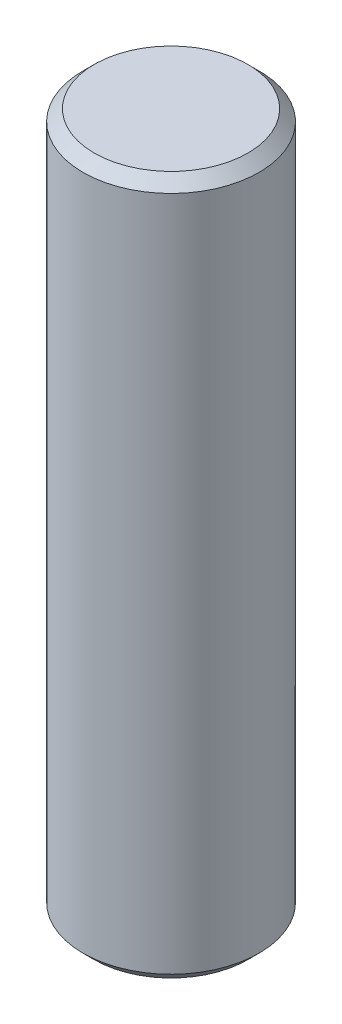
ISO-10303-21;
HEADER;
FILE_DESCRIPTION(('STEP AP214'),'2;1');
FILE_NAME('part.step','',(''),(''),'','','');
FILE_SCHEMA(('AUTOMOTIVE_DESIGN { 1 0 10303 214 1 1 1 1 }'));
ENDSEC;
DATA;
#1=APPLICATION_CONTEXT('core data for automotive mechanical design processes');
#2=APPLICATION_PROTOCOL_DEFINITION('international standard','automotive_design',2000,#1);
#3=PRODUCT_CONTEXT('',#1,'mechanical');
#4=PRODUCT('Part','Part','',(#3));
#5=PRODUCT_RELATED_PRODUCT_CATEGORY('part','',(#4));
#6=PRODUCT_DEFINITION_FORMATION('','',#4);
#7=PRODUCT_DEFINITION_CONTEXT('part definition',#1,'design');
#8=PRODUCT_DEFINITION('design','',#6,#7);
#9=PRODUCT_DEFINITION_SHAPE('','',#8);
#10=(LENGTH_UNIT() NAMED_UNIT(*) SI_UNIT(.MILLI.,.METRE.));
#11=(NAMED_UNIT(*) PLANE_ANGLE_UNIT() SI_UNIT($,.RADIAN.));
#12=(NAMED_UNIT(*) SI_UNIT($,.STERADIAN.) SOLID_ANGLE_UNIT());
#13=UNCERTAINTY_MEASURE_WITH_UNIT(LENGTH_MEASURE(1.E-05),#10,'distance_accuracy_value','');
#14=(GEOMETRIC_REPRESENTATION_CONTEXT(3) GLOBAL_UNCERTAINTY_ASSIGNED_CONTEXT((#13)) GLOBAL_UNIT_ASSIGNED_CONTEXT((#10,
#11,#12)) REPRESENTATION_CONTEXT('',''));
#15=CARTESIAN_POINT('',(0.,0.,0.));
#16=DIRECTION('',(0.,0.,1.));
#17=DIRECTION('',(1.,0.,0.));
#18=AXIS2_PLACEMENT_3D('',#15,#16,#17);
#19=CARTESIAN_POINT('',(0.,31.75,0.));
#20=DIRECTION('',(0.,-1.,0.));
#21=DIRECTION('',(0.,0.,-1.));
#22=AXIS2_PLACEMENT_3D('',#19,#20,#21);
#23=CYLINDRICAL_SURFACE('',#22,4.);
#24=CARTESIAN_POINT('',(0.,0.508000000000008,0.));
#25=DIRECTION('',(0.,1.,0.));
#26=DIRECTION('',(0.,0.,1.));
#27=AXIS2_PLACEMENT_3D('',#24,#25,#26);
#28=CIRCLE('',#27,4.);
#29=CARTESIAN_POINT('',(0.,0.508000000000008,4.));
#30=VERTEX_POINT('',#29);
#31=EDGE_CURVE('E53',#30,#30,#28,.T.);
#32=ORIENTED_EDGE('',*,*,#31,.T.);
#33=EDGE_LOOP('',(#32));
#34=FACE_BOUND('',#33,.T.);
#35=CARTESIAN_POINT('',(0.,31.242,0.));
#36=DIRECTION('',(0.,1.,0.));
#37=DIRECTION('',(0.,0.,1.));
#38=AXIS2_PLACEMENT_3D('',#35,#36,#37);
#39=CIRCLE('',#38,4.);
#40=CARTESIAN_POINT('',(0.,31.242,4.));
#41=VERTEX_POINT('',#40);
#42=EDGE_CURVE('E58',#41,#41,#39,.F.);
#43=ORIENTED_EDGE('',*,*,#42,.T.);
#44=EDGE_LOOP('',(#43));
#45=FACE_BOUND('',#44,.T.);
#46=ADVANCED_FACE('F39',(#34,#45),#23,.T.);
#47=CARTESIAN_POINT('',(0.,31.75,0.));
#48=DIRECTION('',(0.,1.,0.));
#49=DIRECTION('',(0.,0.,1.));
#50=AXIS2_PLACEMENT_3D('',#47,#48,#49);
#51=PLANE('',#50);
#52=CARTESIAN_POINT('',(0.,31.75,0.));
#53=DIRECTION('',(0.,1.,0.));
#54=DIRECTION('',(0.,0.,1.));
#55=AXIS2_PLACEMENT_3D('',#52,#53,#54);
#56=CIRCLE('',#55,3.492);
#57=CARTESIAN_POINT('',(0.,31.75,3.492));
#58=VERTEX_POINT('',#57);
#59=EDGE_CURVE('E10',#58,#58,#56,.T.);
#60=ORIENTED_EDGE('',*,*,#59,.T.);
#61=EDGE_LOOP('',(#60));
#62=FACE_BOUND('',#61,.T.);
#63=ADVANCED_FACE('F75',(#62),#51,.T.);
#64=CARTESIAN_POINT('',(0.,0.,0.));
#65=DIRECTION('',(0.,1.,0.));
#66=DIRECTION('',(0.,0.,1.));
#67=AXIS2_PLACEMENT_3D('',#64,#65,#66);
#68=PLANE('',#67);
#69=CARTESIAN_POINT('',(0.,0.,0.));
#70=DIRECTION('',(0.,1.,0.));
#71=DIRECTION('',(0.,0.,1.));
#72=AXIS2_PLACEMENT_3D('',#69,#70,#71);
#73=CIRCLE('',#72,3.49199999999999);
#74=CARTESIAN_POINT('',(0.,0.,3.49199999999999));
#75=VERTEX_POINT('',#74);
#76=EDGE_CURVE('E48',#75,#75,#73,.F.);
#77=ORIENTED_EDGE('',*,*,#76,.T.);
#78=EDGE_LOOP('',(#77));
#79=FACE_BOUND('',#78,.T.);
#80=ADVANCED_FACE('F72',(#79),#68,.F.);
#81=CARTESIAN_POINT('',(0.,0.508000000000008,0.));
#82=DIRECTION('',(0.,1.,0.));
#83=DIRECTION('',(0.,0.,1.));
#84=AXIS2_PLACEMENT_3D('',#81,#82,#83);
#85=CONICAL_SURFACE('',#84,4.,0.785398163397448);
#86=ORIENTED_EDGE('',*,*,#76,.F.);
#87=EDGE_LOOP('',(#86));
#88=FACE_BOUND('',#87,.T.);
#89=ORIENTED_EDGE('',*,*,#31,.F.);
#90=EDGE_LOOP('',(#89));
#91=FACE_BOUND('',#90,.T.);
#92=ADVANCED_FACE('F68',(#88,#91),#85,.T.);
#93=CARTESIAN_POINT('',(0.,31.75,0.));
#94=DIRECTION('',(0.,-1.,0.));
#95=DIRECTION('',(0.,0.,-1.));
#96=AXIS2_PLACEMENT_3D('',#93,#94,#95);
#97=CONICAL_SURFACE('',#96,3.492,0.785398163397445);
#98=ORIENTED_EDGE('',*,*,#42,.F.);
#99=EDGE_LOOP('',(#98));
#100=FACE_BOUND('',#99,.T.);
#101=ORIENTED_EDGE('',*,*,#59,.F.);
#102=EDGE_LOOP('',(#101));
#103=FACE_BOUND('',#102,.T.);
#104=ADVANCED_FACE('F42',(#100,#103),#97,.T.);
#105=CLOSED_SHELL('',(#46,#63,#80,#92,#104));
#106=MANIFOLD_SOLID_BREP('B2',#105);
#107=ADVANCED_BREP_SHAPE_REPRESENTATION('',(#18,#106),#14);
#108=SHAPE_DEFINITION_REPRESENTATION(#9,#107);
ENDSEC;
END-ISO-10303-21;
